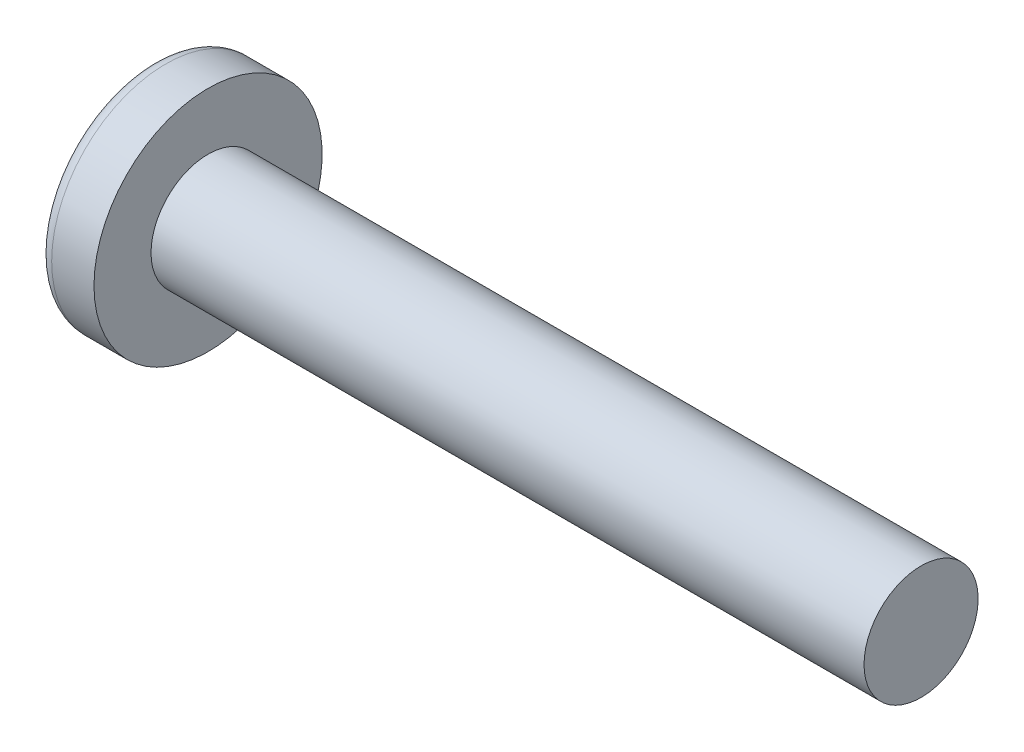
ISO-10303-21;
HEADER;
FILE_DESCRIPTION(('STEP AP214'),'2;1');
FILE_NAME('part.step','',(''),(''),'','','');
FILE_SCHEMA(('AUTOMOTIVE_DESIGN { 1 0 10303 214 1 1 1 1 }'));
ENDSEC;
DATA;
#1=APPLICATION_CONTEXT('core data for automotive mechanical design processes');
#2=APPLICATION_PROTOCOL_DEFINITION('international standard','automotive_design',2000,#1);
#3=PRODUCT_CONTEXT('',#1,'mechanical');
#4=PRODUCT('Part','Part','',(#3));
#5=PRODUCT_RELATED_PRODUCT_CATEGORY('part','',(#4));
#6=PRODUCT_DEFINITION_FORMATION('','',#4);
#7=PRODUCT_DEFINITION_CONTEXT('part definition',#1,'design');
#8=PRODUCT_DEFINITION('design','',#6,#7);
#9=PRODUCT_DEFINITION_SHAPE('','',#8);
#10=(LENGTH_UNIT() NAMED_UNIT(*) SI_UNIT(.MILLI.,.METRE.));
#11=(NAMED_UNIT(*) PLANE_ANGLE_UNIT() SI_UNIT($,.RADIAN.));
#12=(NAMED_UNIT(*) SI_UNIT($,.STERADIAN.) SOLID_ANGLE_UNIT());
#13=UNCERTAINTY_MEASURE_WITH_UNIT(LENGTH_MEASURE(1.E-05),#10,'distance_accuracy_value','');
#14=(GEOMETRIC_REPRESENTATION_CONTEXT(3) GLOBAL_UNCERTAINTY_ASSIGNED_CONTEXT((#13)) GLOBAL_UNIT_ASSIGNED_CONTEXT((#10,
#11,#12)) REPRESENTATION_CONTEXT('',''));
#15=CARTESIAN_POINT('',(0.,0.,0.));
#16=DIRECTION('',(0.,0.,1.));
#17=DIRECTION('',(1.,0.,0.));
#18=AXIS2_PLACEMENT_3D('',#15,#16,#17);
#19=CARTESIAN_POINT('',(6.5,0.,0.));
#20=DIRECTION('',(-1.,0.,0.));
#21=DIRECTION('',(0.,1.,0.));
#22=AXIS2_PLACEMENT_3D('',#19,#20,#21);
#23=SPHERICAL_SURFACE('',#22,6.5);
#24=CARTESIAN_POINT('',(1.22696010591455,0.,0.));
#25=DIRECTION('',(-1.,0.,0.));
#26=DIRECTION('',(0.,0.,1.));
#27=AXIS2_PLACEMENT_3D('',#24,#25,#26);
#28=CIRCLE('',#27,3.80066445182724);
#29=CARTESIAN_POINT('',(1.22696010591455,0.,3.80066445182724));
#30=VERTEX_POINT('',#29);
#31=EDGE_CURVE('E172',#30,#30,#28,.T.);
#32=ORIENTED_EDGE('',*,*,#31,.T.);
#33=EDGE_LOOP('',(#32));
#34=FACE_BOUND('',#33,.T.);
#35=CARTESIAN_POINT('',(6.48571960757402,-0.15048155459631,0.));
#36=DIRECTION('',(-0.0944735162161081,-0.995527375180494,0.));
#37=DIRECTION('',(0.995527375180495,-0.0944735162161082,0.));
#38=AXIS2_PLACEMENT_3D('',#35,#36,#37);
#39=CIRCLE('',#38,6.49824217555166);
#40=CARTESIAN_POINT('',(0.314004666074214,0.435201598015399,1.94783502836694));
#41=VERTEX_POINT('',#40);
#42=CARTESIAN_POINT('',(0.0329034112486453,0.461877533422321,0.461877533422322));
#43=VERTEX_POINT('',#42);
#44=EDGE_CURVE('E214',#41,#43,#39,.T.);
#45=ORIENTED_EDGE('',*,*,#44,.F.);
#46=CARTESIAN_POINT('',(5.02565375064329,0.,-1.83590765485334));
#47=DIRECTION('',(0.626149356629992,0.,0.779703137861998));
#48=DIRECTION('',(0.779703137861998,0.,-0.626149356629992));
#49=AXIS2_PLACEMENT_3D('',#46,#47,#48);
#50=CIRCLE('',#49,6.05852673674539);
#51=CARTESIAN_POINT('',(0.314004666074213,-0.435201598015413,1.94783502836693));
#52=VERTEX_POINT('',#51);
#53=EDGE_CURVE('E167',#41,#52,#50,.T.);
#54=ORIENTED_EDGE('',*,*,#53,.T.);
#55=CARTESIAN_POINT('',(6.48571960757402,0.150481554596309,0.));
#56=DIRECTION('',(-0.0944735162161078,0.995527375180494,0.));
#57=DIRECTION('',(-0.995527375180495,-0.0944735162161079,0.));
#58=AXIS2_PLACEMENT_3D('',#55,#56,#57);
#59=CIRCLE('',#58,6.49824217555166);
#60=CARTESIAN_POINT('',(0.0329034112486444,-0.461877533422323,0.461877533422322));
#61=VERTEX_POINT('',#60);
#62=EDGE_CURVE('E116',#61,#52,#59,.T.);
#63=ORIENTED_EDGE('',*,*,#62,.F.);
#64=CARTESIAN_POINT('',(6.48571960757402,0.,-0.150481554596309));
#65=DIRECTION('',(-0.0944735162161078,0.,-0.995527375180494));
#66=DIRECTION('',(-0.995527375180495,0.,0.0944735162161079));
#67=AXIS2_PLACEMENT_3D('',#64,#65,#66);
#68=CIRCLE('',#67,6.49824217555166);
#69=CARTESIAN_POINT('',(0.314004666074211,-1.94783502836694,0.435201598015406));
#70=VERTEX_POINT('',#69);
#71=EDGE_CURVE('E143',#70,#61,#68,.T.);
#72=ORIENTED_EDGE('',*,*,#71,.F.);
#73=CARTESIAN_POINT('',(5.02565375064329,1.83590765485333,0.));
#74=DIRECTION('',(0.626149356629993,-0.779703137861998,0.));
#75=DIRECTION('',(0.779703137861998,0.626149356629993,0.));
#76=AXIS2_PLACEMENT_3D('',#73,#74,#75);
#77=CIRCLE('',#76,6.05852673674539);
#78=CARTESIAN_POINT('',(0.314004666074211,-1.94783502836694,-0.435201598015407));
#79=VERTEX_POINT('',#78);
#80=EDGE_CURVE('E152',#70,#79,#77,.T.);
#81=ORIENTED_EDGE('',*,*,#80,.T.);
#82=CARTESIAN_POINT('',(6.48571960757402,0.,0.15048155459631));
#83=DIRECTION('',(-0.0944735162161081,0.,0.995527375180494));
#84=DIRECTION('',(0.995527375180495,0.,0.0944735162161082));
#85=AXIS2_PLACEMENT_3D('',#82,#83,#84);
#86=CIRCLE('',#85,6.49824217555166);
#87=CARTESIAN_POINT('',(0.0329034112486453,-0.46187753342232,-0.461877533422323));
#88=VERTEX_POINT('',#87);
#89=EDGE_CURVE('E59',#88,#79,#86,.T.);
#90=ORIENTED_EDGE('',*,*,#89,.F.);
#91=CARTESIAN_POINT('',(0.314004666074213,-0.435201598015399,-1.94783502836694));
#92=VERTEX_POINT('',#91);
#93=EDGE_CURVE('E221',#92,#88,#59,.T.);
#94=ORIENTED_EDGE('',*,*,#93,.F.);
#95=CARTESIAN_POINT('',(5.02565375064329,0.,1.83590765485334));
#96=DIRECTION('',(0.626149356629993,0.,-0.779703137861998));
#97=DIRECTION('',(-0.779703137861998,0.,-0.626149356629993));
#98=AXIS2_PLACEMENT_3D('',#95,#96,#97);
#99=CIRCLE('',#98,6.05852673674539);
#100=CARTESIAN_POINT('',(0.314004666074214,0.435201598015413,-1.94783502836693));
#101=VERTEX_POINT('',#100);
#102=EDGE_CURVE('E145',#92,#101,#99,.T.);
#103=ORIENTED_EDGE('',*,*,#102,.T.);
#104=CARTESIAN_POINT('',(0.0329034112486453,0.461877533422324,-0.461877533422323));
#105=VERTEX_POINT('',#104);
#106=EDGE_CURVE('E210',#105,#101,#39,.T.);
#107=ORIENTED_EDGE('',*,*,#106,.F.);
#108=CARTESIAN_POINT('',(0.314004666074215,1.94783502836693,-0.435201598015406));
#109=VERTEX_POINT('',#108);
#110=EDGE_CURVE('E52',#109,#105,#86,.T.);
#111=ORIENTED_EDGE('',*,*,#110,.F.);
#112=CARTESIAN_POINT('',(5.02565375064329,-1.83590765485334,0.));
#113=DIRECTION('',(0.626149356629992,0.779703137861998,0.));
#114=DIRECTION('',(-0.779703137861998,0.626149356629992,0.));
#115=AXIS2_PLACEMENT_3D('',#112,#113,#114);
#116=CIRCLE('',#115,6.05852673674539);
#117=CARTESIAN_POINT('',(0.314004666074215,1.94783502836693,0.435201598015406));
#118=VERTEX_POINT('',#117);
#119=EDGE_CURVE('E11',#109,#118,#116,.T.);
#120=ORIENTED_EDGE('',*,*,#119,.T.);
#121=EDGE_CURVE('E191',#43,#118,#68,.T.);
#122=ORIENTED_EDGE('',*,*,#121,.F.);
#123=EDGE_LOOP('',(#45,#54,#63,#72,#81,#90,#94,#103,#107,#111,#120,#122));
#124=FACE_BOUND('',#123,.T.);
#125=ADVANCED_FACE('F43',(#34,#124),#23,.T.);
#126=CARTESIAN_POINT('',(2.73951715374841,0.,-0.20502541296061));
#127=DIRECTION('',(-0.0944735162161081,0.,0.995527375180494));
#128=DIRECTION('',(0.995527375180495,0.,0.0944735162161082));
#129=AXIS2_PLACEMENT_3D('',#126,#127,#128);
#130=PLANE('',#129);
#131=ORIENTED_EDGE('',*,*,#110,.T.);
#132=DIRECTION('',(0.991114231601325,-0.0940547178968607,0.0940547178968604));
#133=VECTOR('',#132,1.);
#134=CARTESIAN_POINT('',(2.75862941145706,0.203211698708667,-0.203211698708667));
#135=LINE('',#134,#133);
#136=CARTESIAN_POINT('',(2.45,0.232500000000001,-0.232499999999999));
#137=VERTEX_POINT('',#136);
#138=EDGE_CURVE('E211',#105,#137,#135,.T.);
#139=ORIENTED_EDGE('',*,*,#138,.T.);
#140=DIRECTION('',(0.777577482844895,-0.624442325509115,0.0737905162291584));
#141=VECTOR('',#140,1.);
#142=CARTESIAN_POINT('',(0.,2.2,-0.465));
#143=LINE('',#142,#141);
#144=EDGE_CURVE('E173',#109,#137,#143,.T.);
#145=ORIENTED_EDGE('',*,*,#144,.F.);
#146=EDGE_LOOP('',(#131,#139,#145));
#147=FACE_BOUND('',#146,.T.);
#148=ADVANCED_FACE('F254',(#147),#130,.T.);
#149=DIRECTION('',(0.777577482844895,0.624442325509115,0.0737905162291584));
#150=VECTOR('',#149,1.);
#151=CARTESIAN_POINT('',(0.,-2.2,-0.465));
#152=LINE('',#151,#150);
#153=CARTESIAN_POINT('',(2.45,-0.2325,-0.2325));
#154=VERTEX_POINT('',#153);
#155=EDGE_CURVE('E154',#79,#154,#152,.T.);
#156=ORIENTED_EDGE('',*,*,#155,.T.);
#157=DIRECTION('',(-0.991114231601325,-0.0940547178968598,-0.0940547178968604));
#158=VECTOR('',#157,1.);
#159=CARTESIAN_POINT('',(2.75862941145706,-0.203211698708666,-0.203211698708667));
#160=LINE('',#159,#158);
#161=EDGE_CURVE('E222',#154,#88,#160,.T.);
#162=ORIENTED_EDGE('',*,*,#161,.T.);
#163=ORIENTED_EDGE('',*,*,#89,.T.);
#164=EDGE_LOOP('',(#156,#162,#163));
#165=FACE_BOUND('',#164,.T.);
#166=ADVANCED_FACE('F251',(#165),#130,.T.);
#167=CARTESIAN_POINT('',(2.73951715374841,0.,0.20502541296061));
#168=DIRECTION('',(-0.0944735162161078,0.,-0.995527375180494));
#169=DIRECTION('',(-0.995527375180495,0.,0.0944735162161079));
#170=AXIS2_PLACEMENT_3D('',#167,#168,#169);
#171=PLANE('',#170);
#172=DIRECTION('',(0.777577482844895,-0.624442325509115,-0.0737905162291583));
#173=VECTOR('',#172,1.);
#174=CARTESIAN_POINT('',(0.,2.2,0.465));
#175=LINE('',#174,#173);
#176=CARTESIAN_POINT('',(2.45,0.2325,0.2325));
#177=VERTEX_POINT('',#176);
#178=EDGE_CURVE('E202',#118,#177,#175,.T.);
#179=ORIENTED_EDGE('',*,*,#178,.T.);
#180=DIRECTION('',(-0.991114231601325,0.0940547178968601,0.0940547178968601));
#181=VECTOR('',#180,1.);
#182=CARTESIAN_POINT('',(2.75862941145706,0.203211698708666,0.203211698708667));
#183=LINE('',#182,#181);
#184=EDGE_CURVE('E217',#177,#43,#183,.T.);
#185=ORIENTED_EDGE('',*,*,#184,.T.);
#186=ORIENTED_EDGE('',*,*,#121,.T.);
#187=EDGE_LOOP('',(#179,#185,#186));
#188=FACE_BOUND('',#187,.T.);
#189=ADVANCED_FACE('F253',(#188),#171,.T.);
#190=ORIENTED_EDGE('',*,*,#71,.T.);
#191=DIRECTION('',(0.991114231601325,0.0940547178968604,-0.0940547178968601));
#192=VECTOR('',#191,1.);
#193=CARTESIAN_POINT('',(2.75862941145706,-0.203211698708668,0.203211698708667));
#194=LINE('',#193,#192);
#195=CARTESIAN_POINT('',(2.45,-0.232500000000001,0.232499999999999));
#196=VERTEX_POINT('',#195);
#197=EDGE_CURVE('E114',#61,#196,#194,.T.);
#198=ORIENTED_EDGE('',*,*,#197,.T.);
#199=DIRECTION('',(0.777577482844895,0.624442325509115,-0.0737905162291581));
#200=VECTOR('',#199,1.);
#201=CARTESIAN_POINT('',(0.,-2.2,0.464999999999999));
#202=LINE('',#201,#200);
#203=EDGE_CURVE('E141',#70,#196,#202,.T.);
#204=ORIENTED_EDGE('',*,*,#203,.F.);
#205=EDGE_LOOP('',(#190,#198,#204));
#206=FACE_BOUND('',#205,.T.);
#207=ADVANCED_FACE('F140',(#206),#171,.T.);
#208=CARTESIAN_POINT('',(-25.4,0.,0.));
#209=DIRECTION('',(-1.,0.,0.));
#210=DIRECTION('',(0.,0.,1.));
#211=AXIS2_PLACEMENT_3D('',#208,#209,#210);
#212=CYLINDRICAL_SURFACE('',#211,2.);
#213=CARTESIAN_POINT('',(28.1,0.,0.));
#214=DIRECTION('',(-1.,0.,0.));
#215=DIRECTION('',(0.,0.,1.));
#216=AXIS2_PLACEMENT_3D('',#213,#214,#215);
#217=CIRCLE('',#216,2.);
#218=CARTESIAN_POINT('',(28.1,0.,2.));
#219=VERTEX_POINT('',#218);
#220=EDGE_CURVE('E168',#219,#219,#217,.T.);
#221=ORIENTED_EDGE('',*,*,#220,.T.);
#222=EDGE_LOOP('',(#221));
#223=FACE_BOUND('',#222,.T.);
#224=CARTESIAN_POINT('',(3.1,0.,0.));
#225=DIRECTION('',(-1.,0.,0.));
#226=DIRECTION('',(0.,0.,1.));
#227=AXIS2_PLACEMENT_3D('',#224,#225,#226);
#228=CIRCLE('',#227,2.);
#229=CARTESIAN_POINT('',(3.1,0.,2.));
#230=VERTEX_POINT('',#229);
#231=EDGE_CURVE('E185',#230,#230,#228,.T.);
#232=ORIENTED_EDGE('',*,*,#231,.F.);
#233=EDGE_LOOP('',(#232));
#234=FACE_BOUND('',#233,.T.);
#235=ADVANCED_FACE('F45',(#223,#234),#212,.T.);
#236=CARTESIAN_POINT('',(3.1,2.,0.));
#237=DIRECTION('',(-1.,0.,0.));
#238=DIRECTION('',(0.,0.,1.));
#239=AXIS2_PLACEMENT_3D('',#236,#237,#238);
#240=PLANE('',#239);
#241=CARTESIAN_POINT('',(3.1,0.,0.));
#242=DIRECTION('',(-1.,0.,0.));
#243=DIRECTION('',(0.,0.,1.));
#244=AXIS2_PLACEMENT_3D('',#241,#242,#243);
#245=CIRCLE('',#244,4.);
#246=CARTESIAN_POINT('',(3.1,0.,4.));
#247=VERTEX_POINT('',#246);
#248=EDGE_CURVE('E181',#247,#247,#245,.T.);
#249=ORIENTED_EDGE('',*,*,#248,.F.);
#250=EDGE_LOOP('',(#249));
#251=FACE_BOUND('',#250,.T.);
#252=ORIENTED_EDGE('',*,*,#231,.T.);
#253=EDGE_LOOP('',(#252));
#254=FACE_BOUND('',#253,.T.);
#255=ADVANCED_FACE('F278',(#251,#254),#240,.F.);
#256=CARTESIAN_POINT('',(-25.4,0.,0.));
#257=DIRECTION('',(-1.,0.,0.));
#258=DIRECTION('',(0.,0.,1.));
#259=AXIS2_PLACEMENT_3D('',#256,#257,#258);
#260=CYLINDRICAL_SURFACE('',#259,4.);
#261=ORIENTED_EDGE('',*,*,#248,.T.);
#262=EDGE_LOOP('',(#261));
#263=FACE_BOUND('',#262,.T.);
#264=CARTESIAN_POINT('',(1.61635382117009,0.,0.));
#265=DIRECTION('',(-1.,0.,0.));
#266=DIRECTION('',(0.,0.,1.));
#267=AXIS2_PLACEMENT_3D('',#264,#265,#266);
#268=CIRCLE('',#267,4.);
#269=CARTESIAN_POINT('',(1.61635382117009,0.,4.));
#270=VERTEX_POINT('',#269);
#271=EDGE_CURVE('E177',#270,#270,#268,.T.);
#272=ORIENTED_EDGE('',*,*,#271,.F.);
#273=EDGE_LOOP('',(#272));
#274=FACE_BOUND('',#273,.T.);
#275=ADVANCED_FACE('F275',(#263,#274),#260,.T.);
#276=CARTESIAN_POINT('',(1.61635382117009,0.,0.));
#277=DIRECTION('',(-1.,0.,0.));
#278=DIRECTION('',(0.,0.,1.));
#279=AXIS2_PLACEMENT_3D('',#276,#277,#278);
#280=TOROIDAL_SURFACE('',#279,3.52,0.479999999999999);
#281=ORIENTED_EDGE('',*,*,#271,.T.);
#282=EDGE_LOOP('',(#281));
#283=FACE_BOUND('',#282,.T.);
#284=ORIENTED_EDGE('',*,*,#31,.F.);
#285=EDGE_LOOP('',(#284));
#286=FACE_BOUND('',#285,.T.);
#287=ADVANCED_FACE('F272',(#283,#286),#280,.T.);
#288=CARTESIAN_POINT('',(28.1,2.,0.));
#289=DIRECTION('',(1.,0.,0.));
#290=DIRECTION('',(0.,0.,-1.));
#291=AXIS2_PLACEMENT_3D('',#288,#289,#290);
#292=PLANE('',#291);
#293=ORIENTED_EDGE('',*,*,#220,.F.);
#294=EDGE_LOOP('',(#293));
#295=FACE_BOUND('',#294,.T.);
#296=ADVANCED_FACE('F270',(#295),#292,.T.);
#297=CARTESIAN_POINT('',(2.45,0.2325,0.2325));
#298=DIRECTION('',(0.626149356629992,0.779703137861998,0.));
#299=DIRECTION('',(-0.779703137861998,0.626149356629992,0.));
#300=AXIS2_PLACEMENT_3D('',#297,#298,#299);
#301=PLANE('',#300);
#302=ORIENTED_EDGE('',*,*,#144,.T.);
#303=DIRECTION('',(0.,0.,-1.));
#304=VECTOR('',#303,1.);
#305=CARTESIAN_POINT('',(2.45,0.2325,0.2325));
#306=LINE('',#305,#304);
#307=EDGE_CURVE('E134',#177,#137,#306,.T.);
#308=ORIENTED_EDGE('',*,*,#307,.F.);
#309=ORIENTED_EDGE('',*,*,#178,.F.);
#310=ORIENTED_EDGE('',*,*,#119,.F.);
#311=EDGE_LOOP('',(#302,#308,#309,#310));
#312=FACE_BOUND('',#311,.T.);
#313=ADVANCED_FACE('F300',(#312),#301,.F.);
#314=CARTESIAN_POINT('',(2.45,-0.2325,-0.2325));
#315=DIRECTION('',(0.626149356629993,-0.779703137861998,0.));
#316=DIRECTION('',(0.779703137861998,0.626149356629993,0.));
#317=AXIS2_PLACEMENT_3D('',#314,#315,#316);
#318=PLANE('',#317);
#319=ORIENTED_EDGE('',*,*,#203,.T.);
#320=DIRECTION('',(0.,0.,1.));
#321=VECTOR('',#320,1.);
#322=CARTESIAN_POINT('',(2.45,-0.2325,-0.2325));
#323=LINE('',#322,#321);
#324=EDGE_CURVE('E133',#154,#196,#323,.T.);
#325=ORIENTED_EDGE('',*,*,#324,.F.);
#326=ORIENTED_EDGE('',*,*,#155,.F.);
#327=ORIENTED_EDGE('',*,*,#80,.F.);
#328=EDGE_LOOP('',(#319,#325,#326,#327));
#329=FACE_BOUND('',#328,.T.);
#330=ADVANCED_FACE('F149',(#329),#318,.F.);
#331=CARTESIAN_POINT('',(2.45,-0.2325,-0.2325));
#332=DIRECTION('',(1.,0.,0.));
#333=DIRECTION('',(0.,0.,-1.));
#334=AXIS2_PLACEMENT_3D('',#331,#332,#333);
#335=PLANE('',#334);
#336=DIRECTION('',(0.,1.,0.));
#337=VECTOR('',#336,1.);
#338=CARTESIAN_POINT('',(2.45,-0.2325,-0.2325));
#339=LINE('',#338,#337);
#340=EDGE_CURVE('E158',#154,#137,#339,.T.);
#341=ORIENTED_EDGE('',*,*,#340,.F.);
#342=ORIENTED_EDGE('',*,*,#324,.T.);
#343=DIRECTION('',(0.,-1.,0.));
#344=VECTOR('',#343,1.);
#345=CARTESIAN_POINT('',(2.45,0.2325,0.2325));
#346=LINE('',#345,#344);
#347=EDGE_CURVE('E124',#177,#196,#346,.T.);
#348=ORIENTED_EDGE('',*,*,#347,.F.);
#349=ORIENTED_EDGE('',*,*,#307,.T.);
#350=EDGE_LOOP('',(#341,#342,#348,#349));
#351=FACE_BOUND('',#350,.T.);
#352=ADVANCED_FACE('F156',(#351),#335,.F.);
#353=CARTESIAN_POINT('',(2.45,0.232500000000001,-0.232499999999999));
#354=DIRECTION('',(0.626149356629993,0.,-0.779703137861998));
#355=DIRECTION('',(0.779703137861998,0.,0.626149356629993));
#356=AXIS2_PLACEMENT_3D('',#353,#354,#355);
#357=PLANE('',#356);
#358=DIRECTION('',(0.777577482844895,0.0737905162291559,0.624442325509115));
#359=VECTOR('',#358,1.);
#360=CARTESIAN_POINT('',(0.,-0.464999999999991,-2.2));
#361=LINE('',#360,#359);
#362=EDGE_CURVE('E230',#92,#154,#361,.T.);
#363=ORIENTED_EDGE('',*,*,#362,.T.);
#364=ORIENTED_EDGE('',*,*,#340,.T.);
#365=DIRECTION('',(0.777577482844895,-0.0737905162291606,0.624442325509115));
#366=VECTOR('',#365,1.);
#367=CARTESIAN_POINT('',(0.,0.465000000000008,-2.2));
#368=LINE('',#367,#366);
#369=EDGE_CURVE('E121',#101,#137,#368,.T.);
#370=ORIENTED_EDGE('',*,*,#369,.F.);
#371=ORIENTED_EDGE('',*,*,#102,.F.);
#372=EDGE_LOOP('',(#363,#364,#370,#371));
#373=FACE_BOUND('',#372,.T.);
#374=ADVANCED_FACE('F244',(#373),#357,.F.);
#375=CARTESIAN_POINT('',(2.73951715374841,-0.20502541296061,0.));
#376=DIRECTION('',(-0.0944735162161078,0.995527375180494,0.));
#377=DIRECTION('',(-0.995527375180495,-0.0944735162161079,0.));
#378=AXIS2_PLACEMENT_3D('',#375,#376,#377);
#379=PLANE('',#378);
#380=ORIENTED_EDGE('',*,*,#93,.T.);
#381=ORIENTED_EDGE('',*,*,#161,.F.);
#382=ORIENTED_EDGE('',*,*,#362,.F.);
#383=EDGE_LOOP('',(#380,#381,#382));
#384=FACE_BOUND('',#383,.T.);
#385=ADVANCED_FACE('F250',(#384),#379,.T.);
#386=CARTESIAN_POINT('',(2.73951715374841,0.20502541296061,0.));
#387=DIRECTION('',(-0.0944735162161081,-0.995527375180494,0.));
#388=DIRECTION('',(0.995527375180495,-0.0944735162161082,0.));
#389=AXIS2_PLACEMENT_3D('',#386,#387,#388);
#390=PLANE('',#389);
#391=ORIENTED_EDGE('',*,*,#106,.T.);
#392=ORIENTED_EDGE('',*,*,#369,.T.);
#393=ORIENTED_EDGE('',*,*,#138,.F.);
#394=EDGE_LOOP('',(#391,#392,#393));
#395=FACE_BOUND('',#394,.T.);
#396=ADVANCED_FACE('F241',(#395),#390,.T.);
#397=CARTESIAN_POINT('',(2.45,-0.232500000000001,0.232499999999999));
#398=DIRECTION('',(0.626149356629992,0.,0.779703137861998));
#399=DIRECTION('',(-0.779703137861998,0.,0.626149356629992));
#400=AXIS2_PLACEMENT_3D('',#397,#398,#399);
#401=PLANE('',#400);
#402=DIRECTION('',(0.777577482844895,-0.0737905162291562,-0.624442325509115));
#403=VECTOR('',#402,1.);
#404=CARTESIAN_POINT('',(0.,0.464999999999992,2.2));
#405=LINE('',#404,#403);
#406=EDGE_CURVE('E120',#41,#177,#405,.T.);
#407=ORIENTED_EDGE('',*,*,#406,.T.);
#408=ORIENTED_EDGE('',*,*,#347,.T.);
#409=DIRECTION('',(0.777577482844895,0.0737905162291604,-0.624442325509114));
#410=VECTOR('',#409,1.);
#411=CARTESIAN_POINT('',(0.,-0.465000000000007,2.2));
#412=LINE('',#411,#410);
#413=EDGE_CURVE('E110',#52,#196,#412,.T.);
#414=ORIENTED_EDGE('',*,*,#413,.F.);
#415=ORIENTED_EDGE('',*,*,#53,.F.);
#416=EDGE_LOOP('',(#407,#408,#414,#415));
#417=FACE_BOUND('',#416,.T.);
#418=ADVANCED_FACE('F125',(#417),#401,.F.);
#419=ORIENTED_EDGE('',*,*,#44,.T.);
#420=ORIENTED_EDGE('',*,*,#184,.F.);
#421=ORIENTED_EDGE('',*,*,#406,.F.);
#422=EDGE_LOOP('',(#419,#420,#421));
#423=FACE_BOUND('',#422,.T.);
#424=ADVANCED_FACE('F315',(#423),#390,.T.);
#425=ORIENTED_EDGE('',*,*,#62,.T.);
#426=ORIENTED_EDGE('',*,*,#413,.T.);
#427=ORIENTED_EDGE('',*,*,#197,.F.);
#428=EDGE_LOOP('',(#425,#426,#427));
#429=FACE_BOUND('',#428,.T.);
#430=ADVANCED_FACE('F112',(#429),#379,.T.);
#431=CLOSED_SHELL('',(#125,#148,#166,#189,#207,#235,#255,#275,#287,#296,#313,#330,#352,#374,
#385,#396,#418,#424,#430));
#432=MANIFOLD_SOLID_BREP('B2',#431);
#433=ADVANCED_BREP_SHAPE_REPRESENTATION('',(#18,#432),#14);
#434=SHAPE_DEFINITION_REPRESENTATION(#9,#433);
ENDSEC;
END-ISO-10303-21;
